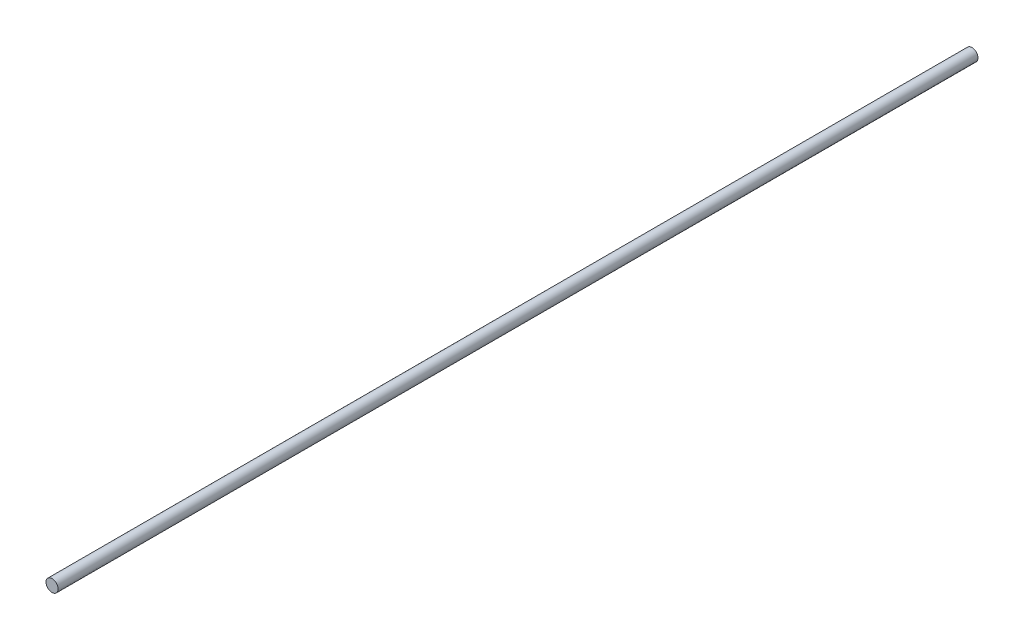
ISO-10303-21;
HEADER;
FILE_DESCRIPTION(('STEP AP214'),'2;1');
FILE_NAME('part.step','',(''),(''),'','','');
FILE_SCHEMA(('AUTOMOTIVE_DESIGN { 1 0 10303 214 1 1 1 1 }'));
ENDSEC;
DATA;
#1=APPLICATION_CONTEXT('core data for automotive mechanical design processes');
#2=APPLICATION_PROTOCOL_DEFINITION('international standard','automotive_design',2000,#1);
#3=PRODUCT_CONTEXT('',#1,'mechanical');
#4=PRODUCT('Part','Part','',(#3));
#5=PRODUCT_RELATED_PRODUCT_CATEGORY('part','',(#4));
#6=PRODUCT_DEFINITION_FORMATION('','',#4);
#7=PRODUCT_DEFINITION_CONTEXT('part definition',#1,'design');
#8=PRODUCT_DEFINITION('design','',#6,#7);
#9=PRODUCT_DEFINITION_SHAPE('','',#8);
#10=(LENGTH_UNIT() NAMED_UNIT(*) SI_UNIT(.MILLI.,.METRE.));
#11=(NAMED_UNIT(*) PLANE_ANGLE_UNIT() SI_UNIT($,.RADIAN.));
#12=(NAMED_UNIT(*) SI_UNIT($,.STERADIAN.) SOLID_ANGLE_UNIT());
#13=UNCERTAINTY_MEASURE_WITH_UNIT(LENGTH_MEASURE(1.E-05),#10,'distance_accuracy_value','');
#14=(GEOMETRIC_REPRESENTATION_CONTEXT(3) GLOBAL_UNCERTAINTY_ASSIGNED_CONTEXT((#13)) GLOBAL_UNIT_ASSIGNED_CONTEXT((#10,
#11,#12)) REPRESENTATION_CONTEXT('',''));
#15=CARTESIAN_POINT('',(0.,0.,0.));
#16=DIRECTION('',(0.,0.,1.));
#17=DIRECTION('',(1.,0.,0.));
#18=AXIS2_PLACEMENT_3D('',#15,#16,#17);
#19=CARTESIAN_POINT('',(0.,0.,482.6));
#20=DIRECTION('',(0.,0.,-1.));
#21=DIRECTION('',(-1.,0.,0.));
#22=AXIS2_PLACEMENT_3D('',#19,#20,#21);
#23=CYLINDRICAL_SURFACE('',#22,3.175);
#24=CARTESIAN_POINT('',(0.,0.,482.6));
#25=DIRECTION('',(0.,0.,1.));
#26=DIRECTION('',(1.,0.,0.));
#27=AXIS2_PLACEMENT_3D('',#24,#25,#26);
#28=CIRCLE('',#27,3.175);
#29=CARTESIAN_POINT('',(3.175,0.,482.6));
#30=VERTEX_POINT('',#29);
#31=EDGE_CURVE('E10',#30,#30,#28,.T.);
#32=ORIENTED_EDGE('',*,*,#31,.F.);
#33=EDGE_LOOP('',(#32));
#34=FACE_BOUND('',#33,.T.);
#35=CARTESIAN_POINT('',(0.,0.,0.));
#36=DIRECTION('',(0.,0.,1.));
#37=DIRECTION('',(1.,0.,0.));
#38=AXIS2_PLACEMENT_3D('',#35,#36,#37);
#39=CIRCLE('',#38,3.175);
#40=CARTESIAN_POINT('',(3.175,0.,0.));
#41=VERTEX_POINT('',#40);
#42=EDGE_CURVE('E35',#41,#41,#39,.T.);
#43=ORIENTED_EDGE('',*,*,#42,.T.);
#44=EDGE_LOOP('',(#43));
#45=FACE_BOUND('',#44,.T.);
#46=ADVANCED_FACE('F32',(#34,#45),#23,.T.);
#47=CARTESIAN_POINT('',(0.,0.,482.6));
#48=DIRECTION('',(0.,0.,1.));
#49=DIRECTION('',(1.,0.,0.));
#50=AXIS2_PLACEMENT_3D('',#47,#48,#49);
#51=PLANE('',#50);
#52=ORIENTED_EDGE('',*,*,#31,.T.);
#53=EDGE_LOOP('',(#52));
#54=FACE_BOUND('',#53,.T.);
#55=ADVANCED_FACE('F47',(#54),#51,.T.);
#56=CARTESIAN_POINT('',(0.,0.,0.));
#57=DIRECTION('',(0.,0.,1.));
#58=DIRECTION('',(1.,0.,0.));
#59=AXIS2_PLACEMENT_3D('',#56,#57,#58);
#60=PLANE('',#59);
#61=ORIENTED_EDGE('',*,*,#42,.F.);
#62=EDGE_LOOP('',(#61));
#63=FACE_BOUND('',#62,.T.);
#64=ADVANCED_FACE('F45',(#63),#60,.F.);
#65=CLOSED_SHELL('',(#46,#55,#64));
#66=MANIFOLD_SOLID_BREP('B2',#65);
#67=ADVANCED_BREP_SHAPE_REPRESENTATION('',(#18,#66),#14);
#68=SHAPE_DEFINITION_REPRESENTATION(#9,#67);
ENDSEC;
END-ISO-10303-21;
